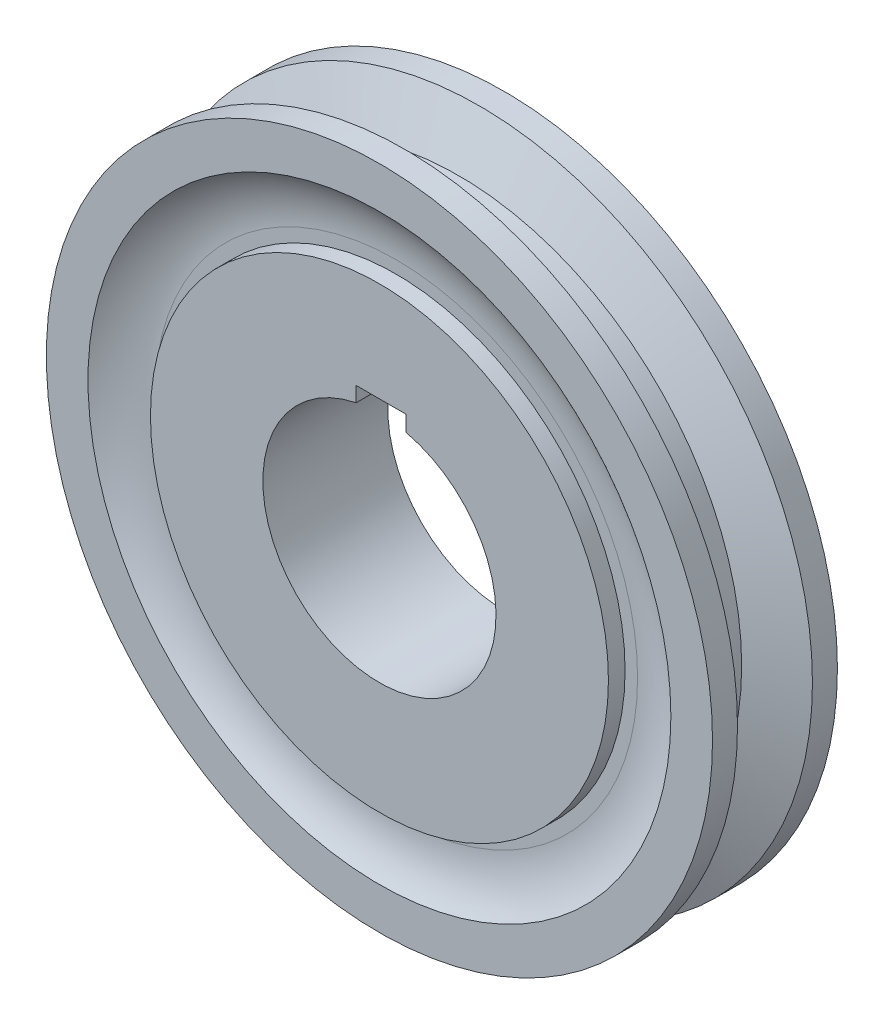
ISO-10303-21;
HEADER;
FILE_DESCRIPTION(('STEP AP214'),'2;1');
FILE_NAME('part.step','',(''),(''),'','','');
FILE_SCHEMA(('AUTOMOTIVE_DESIGN { 1 0 10303 214 1 1 1 1 }'));
ENDSEC;
DATA;
#1=APPLICATION_CONTEXT('core data for automotive mechanical design processes');
#2=APPLICATION_PROTOCOL_DEFINITION('international standard','automotive_design',2000,#1);
#3=PRODUCT_CONTEXT('',#1,'mechanical');
#4=PRODUCT('Part','Part','',(#3));
#5=PRODUCT_RELATED_PRODUCT_CATEGORY('part','',(#4));
#6=PRODUCT_DEFINITION_FORMATION('','',#4);
#7=PRODUCT_DEFINITION_CONTEXT('part definition',#1,'design');
#8=PRODUCT_DEFINITION('design','',#6,#7);
#9=PRODUCT_DEFINITION_SHAPE('','',#8);
#10=(LENGTH_UNIT() NAMED_UNIT(*) SI_UNIT(.MILLI.,.METRE.));
#11=(NAMED_UNIT(*) PLANE_ANGLE_UNIT() SI_UNIT($,.RADIAN.));
#12=(NAMED_UNIT(*) SI_UNIT($,.STERADIAN.) SOLID_ANGLE_UNIT());
#13=UNCERTAINTY_MEASURE_WITH_UNIT(LENGTH_MEASURE(1.E-05),#10,'distance_accuracy_value','');
#14=(GEOMETRIC_REPRESENTATION_CONTEXT(3) GLOBAL_UNCERTAINTY_ASSIGNED_CONTEXT((#13)) GLOBAL_UNIT_ASSIGNED_CONTEXT((#10,
#11,#12)) REPRESENTATION_CONTEXT('',''));
#15=CARTESIAN_POINT('',(0.,0.,0.));
#16=DIRECTION('',(0.,0.,1.));
#17=DIRECTION('',(1.,0.,0.));
#18=AXIS2_PLACEMENT_3D('',#15,#16,#17);
#19=CARTESIAN_POINT('',(0.,0.,-7.5));
#20=DIRECTION('',(0.,0.,-1.));
#21=DIRECTION('',(-1.,0.,0.));
#22=AXIS2_PLACEMENT_3D('',#19,#20,#21);
#23=PLANE('',#22);
#24=CARTESIAN_POINT('',(0.,0.,-7.49999999999995));
#25=DIRECTION('',(0.,0.,1.));
#26=DIRECTION('',(1.,0.,0.));
#27=AXIS2_PLACEMENT_3D('',#24,#25,#26);
#28=CIRCLE('',#27,14.);
#29=CARTESIAN_POINT('',(-2.8,13.7171425595858,-7.49999999999995));
#30=VERTEX_POINT('',#29);
#31=CARTESIAN_POINT('',(3.2,13.6293800299207,-7.49999999999995));
#32=VERTEX_POINT('',#31);
#33=EDGE_CURVE('E89',#30,#32,#28,.T.);
#34=ORIENTED_EDGE('',*,*,#33,.T.);
#35=DIRECTION('',(0.,1.,0.));
#36=VECTOR('',#35,1.);
#37=CARTESIAN_POINT('',(3.2,15.5202041028867,-7.49999999999995));
#38=LINE('',#37,#36);
#39=CARTESIAN_POINT('',(3.2,15.5202041028867,-7.5));
#40=VERTEX_POINT('',#39);
#41=EDGE_CURVE('E99',#32,#40,#38,.T.);
#42=ORIENTED_EDGE('',*,*,#41,.T.);
#43=DIRECTION('',(-1.,0.,0.));
#44=VECTOR('',#43,1.);
#45=CARTESIAN_POINT('',(3.2,15.5202041028867,-7.49999999999995));
#46=LINE('',#45,#44);
#47=CARTESIAN_POINT('',(-2.8,15.5202041028867,-7.49999999999995));
#48=VERTEX_POINT('',#47);
#49=EDGE_CURVE('E69',#40,#48,#46,.T.);
#50=ORIENTED_EDGE('',*,*,#49,.T.);
#51=DIRECTION('',(0.,-1.,0.));
#52=VECTOR('',#51,1.);
#53=CARTESIAN_POINT('',(-2.8,15.5202041028867,-7.49999999999995));
#54=LINE('',#53,#52);
#55=EDGE_CURVE('E96',#48,#30,#54,.T.);
#56=ORIENTED_EDGE('',*,*,#55,.T.);
#57=EDGE_LOOP('',(#34,#42,#50,#56));
#58=FACE_BOUND('',#57,.T.);
#59=CARTESIAN_POINT('',(0.,0.,-7.5));
#60=DIRECTION('',(0.,0.,-1.));
#61=DIRECTION('',(-1.,0.,0.));
#62=AXIS2_PLACEMENT_3D('',#59,#60,#61);
#63=CIRCLE('',#62,27.5);
#64=CARTESIAN_POINT('',(-27.5,0.,-7.5));
#65=VERTEX_POINT('',#64);
#66=EDGE_CURVE('E252',#65,#65,#63,.T.);
#67=ORIENTED_EDGE('',*,*,#66,.T.);
#68=EDGE_LOOP('',(#67));
#69=FACE_BOUND('',#68,.T.);
#70=ADVANCED_FACE('F45',(#58,#69),#23,.T.);
#71=CARTESIAN_POINT('',(0.,0.,7.5));
#72=DIRECTION('',(0.,0.,-1.));
#73=DIRECTION('',(-1.,0.,0.));
#74=AXIS2_PLACEMENT_3D('',#71,#72,#73);
#75=PLANE('',#74);
#76=DIRECTION('',(0.,1.,0.));
#77=VECTOR('',#76,1.);
#78=CARTESIAN_POINT('',(3.2,15.5202041028867,7.5));
#79=LINE('',#78,#77);
#80=CARTESIAN_POINT('',(3.2,13.6293800299207,7.5));
#81=VERTEX_POINT('',#80);
#82=CARTESIAN_POINT('',(3.2,15.5202041028867,7.5));
#83=VERTEX_POINT('',#82);
#84=EDGE_CURVE('E123',#81,#83,#79,.T.);
#85=ORIENTED_EDGE('',*,*,#84,.F.);
#86=CARTESIAN_POINT('',(0.,0.,7.5));
#87=DIRECTION('',(0.,0.,1.));
#88=DIRECTION('',(1.,0.,0.));
#89=AXIS2_PLACEMENT_3D('',#86,#87,#88);
#90=CIRCLE('',#89,14.);
#91=CARTESIAN_POINT('',(-2.8,13.7171425595858,7.5));
#92=VERTEX_POINT('',#91);
#93=EDGE_CURVE('E61',#92,#81,#90,.T.);
#94=ORIENTED_EDGE('',*,*,#93,.F.);
#95=DIRECTION('',(0.,-1.,0.));
#96=VECTOR('',#95,1.);
#97=CARTESIAN_POINT('',(-2.8,15.5202041028867,7.5));
#98=LINE('',#97,#96);
#99=CARTESIAN_POINT('',(-2.8,15.5202041028867,7.5));
#100=VERTEX_POINT('',#99);
#101=EDGE_CURVE('E107',#100,#92,#98,.T.);
#102=ORIENTED_EDGE('',*,*,#101,.F.);
#103=DIRECTION('',(-1.,0.,0.));
#104=VECTOR('',#103,1.);
#105=CARTESIAN_POINT('',(3.2,15.5202041028867,7.5));
#106=LINE('',#105,#104);
#107=EDGE_CURVE('E111',#83,#100,#106,.T.);
#108=ORIENTED_EDGE('',*,*,#107,.F.);
#109=EDGE_LOOP('',(#85,#94,#102,#108));
#110=FACE_BOUND('',#109,.T.);
#111=CARTESIAN_POINT('',(0.,0.,7.5));
#112=DIRECTION('',(0.,0.,1.));
#113=DIRECTION('',(1.,0.,0.));
#114=AXIS2_PLACEMENT_3D('',#111,#112,#113);
#115=CIRCLE('',#114,27.5);
#116=CARTESIAN_POINT('',(27.5,0.,7.5));
#117=VERTEX_POINT('',#116);
#118=EDGE_CURVE('E256',#117,#117,#115,.T.);
#119=ORIENTED_EDGE('',*,*,#118,.T.);
#120=EDGE_LOOP('',(#119));
#121=FACE_BOUND('',#120,.T.);
#122=ADVANCED_FACE('F182',(#110,#121),#75,.F.);
#123=CARTESIAN_POINT('',(0.,0.,652.003718610747));
#124=DIRECTION('',(0.,0.,1.));
#125=DIRECTION('',(1.,0.,0.));
#126=AXIS2_PLACEMENT_3D('',#123,#124,#125);
#127=CYLINDRICAL_SURFACE('',#126,40.);
#128=CARTESIAN_POINT('',(0.,0.,4.49999999999995));
#129=DIRECTION('',(0.,0.,1.));
#130=DIRECTION('',(1.,0.,0.));
#131=AXIS2_PLACEMENT_3D('',#128,#129,#130);
#132=CIRCLE('',#131,40.);
#133=CARTESIAN_POINT('',(40.,0.,4.49999999999995));
#134=VERTEX_POINT('',#133);
#135=EDGE_CURVE('E132',#134,#134,#132,.T.);
#136=ORIENTED_EDGE('',*,*,#135,.T.);
#137=EDGE_LOOP('',(#136));
#138=FACE_BOUND('',#137,.T.);
#139=CARTESIAN_POINT('',(0.,0.,7.49999999999995));
#140=DIRECTION('',(0.,0.,1.));
#141=DIRECTION('',(1.,0.,0.));
#142=AXIS2_PLACEMENT_3D('',#139,#140,#141);
#143=CIRCLE('',#142,40.);
#144=CARTESIAN_POINT('',(40.,0.,7.49999999999995));
#145=VERTEX_POINT('',#144);
#146=EDGE_CURVE('E157',#145,#145,#143,.T.);
#147=ORIENTED_EDGE('',*,*,#146,.F.);
#148=EDGE_LOOP('',(#147));
#149=FACE_BOUND('',#148,.T.);
#150=ADVANCED_FACE('F188',(#138,#149),#127,.T.);
#151=CARTESIAN_POINT('',(0.,0.,7.5));
#152=DIRECTION('',(0.,0.,1.));
#153=DIRECTION('',(1.,0.,0.));
#154=AXIS2_PLACEMENT_3D('',#151,#152,#153);
#155=CIRCLE('',#154,35.);
#156=CARTESIAN_POINT('',(35.,0.,7.5));
#157=VERTEX_POINT('',#156);
#158=EDGE_CURVE('E114',#157,#157,#155,.T.);
#159=ORIENTED_EDGE('',*,*,#158,.F.);
#160=EDGE_LOOP('',(#159));
#161=FACE_BOUND('',#160,.T.);
#162=ORIENTED_EDGE('',*,*,#146,.T.);
#163=EDGE_LOOP('',(#162));
#164=FACE_BOUND('',#163,.T.);
#165=ADVANCED_FACE('F191',(#161,#164),#75,.F.);
#166=CARTESIAN_POINT('',(0.,0.,-7.5));
#167=DIRECTION('',(0.,0.,-1.));
#168=DIRECTION('',(-1.,0.,0.));
#169=AXIS2_PLACEMENT_3D('',#166,#167,#168);
#170=CIRCLE('',#169,35.);
#171=CARTESIAN_POINT('',(-35.,0.,-7.5));
#172=VERTEX_POINT('',#171);
#173=EDGE_CURVE('E206',#172,#172,#170,.T.);
#174=ORIENTED_EDGE('',*,*,#173,.F.);
#175=EDGE_LOOP('',(#174));
#176=FACE_BOUND('',#175,.T.);
#177=CARTESIAN_POINT('',(0.,0.,-7.49999999999995));
#178=DIRECTION('',(0.,0.,1.));
#179=DIRECTION('',(1.,0.,0.));
#180=AXIS2_PLACEMENT_3D('',#177,#178,#179);
#181=CIRCLE('',#180,40.);
#182=CARTESIAN_POINT('',(40.,0.,-7.49999999999995));
#183=VERTEX_POINT('',#182);
#184=EDGE_CURVE('E153',#183,#183,#181,.T.);
#185=ORIENTED_EDGE('',*,*,#184,.F.);
#186=EDGE_LOOP('',(#185));
#187=FACE_BOUND('',#186,.T.);
#188=ADVANCED_FACE('F184',(#176,#187),#23,.T.);
#189=CARTESIAN_POINT('',(0.,0.,652.003718610747));
#190=DIRECTION('',(0.,0.,1.));
#191=DIRECTION('',(1.,0.,0.));
#192=AXIS2_PLACEMENT_3D('',#189,#190,#191);
#193=CYLINDRICAL_SURFACE('',#192,40.);
#194=ORIENTED_EDGE('',*,*,#184,.T.);
#195=EDGE_LOOP('',(#194));
#196=FACE_BOUND('',#195,.T.);
#197=CARTESIAN_POINT('',(0.,0.,-4.49999999999995));
#198=DIRECTION('',(0.,0.,1.));
#199=DIRECTION('',(1.,0.,0.));
#200=AXIS2_PLACEMENT_3D('',#197,#198,#199);
#201=CIRCLE('',#200,40.);
#202=CARTESIAN_POINT('',(40.,0.,-4.49999999999995));
#203=VERTEX_POINT('',#202);
#204=EDGE_CURVE('E149',#203,#203,#201,.T.);
#205=ORIENTED_EDGE('',*,*,#204,.F.);
#206=EDGE_LOOP('',(#205));
#207=FACE_BOUND('',#206,.T.);
#208=ADVANCED_FACE('F194',(#196,#207),#193,.T.);
#209=CARTESIAN_POINT('',(0.,0.,-4.49999999999995));
#210=DIRECTION('',(0.,0.,-1.));
#211=DIRECTION('',(-1.,0.,0.));
#212=AXIS2_PLACEMENT_3D('',#209,#210,#211);
#213=CONICAL_SURFACE('',#212,40.,1.17600520709514);
#214=CARTESIAN_POINT('',(0.,0.,-2.));
#215=DIRECTION('',(0.,0.,1.));
#216=DIRECTION('',(1.,0.,0.));
#217=AXIS2_PLACEMENT_3D('',#214,#215,#216);
#218=CIRCLE('',#217,34.);
#219=CARTESIAN_POINT('',(34.,0.,-2.));
#220=VERTEX_POINT('',#219);
#221=EDGE_CURVE('E145',#220,#220,#218,.T.);
#222=ORIENTED_EDGE('',*,*,#221,.F.);
#223=EDGE_LOOP('',(#222));
#224=FACE_BOUND('',#223,.T.);
#225=ORIENTED_EDGE('',*,*,#204,.T.);
#226=EDGE_LOOP('',(#225));
#227=FACE_BOUND('',#226,.T.);
#228=ADVANCED_FACE('F200',(#224,#227),#213,.T.);
#229=CARTESIAN_POINT('',(0.,0.,652.003718610747));
#230=DIRECTION('',(0.,0.,1.));
#231=DIRECTION('',(1.,0.,0.));
#232=AXIS2_PLACEMENT_3D('',#229,#230,#231);
#233=CYLINDRICAL_SURFACE('',#232,34.);
#234=CARTESIAN_POINT('',(0.,0.,2.));
#235=DIRECTION('',(0.,0.,1.));
#236=DIRECTION('',(1.,0.,0.));
#237=AXIS2_PLACEMENT_3D('',#234,#235,#236);
#238=CIRCLE('',#237,34.);
#239=CARTESIAN_POINT('',(34.,0.,2.));
#240=VERTEX_POINT('',#239);
#241=EDGE_CURVE('E141',#240,#240,#238,.T.);
#242=ORIENTED_EDGE('',*,*,#241,.F.);
#243=EDGE_LOOP('',(#242));
#244=FACE_BOUND('',#243,.T.);
#245=ORIENTED_EDGE('',*,*,#221,.T.);
#246=EDGE_LOOP('',(#245));
#247=FACE_BOUND('',#246,.T.);
#248=ADVANCED_FACE('F212',(#244,#247),#233,.T.);
#249=CARTESIAN_POINT('',(0.,0.,4.49999999999995));
#250=DIRECTION('',(0.,0.,1.));
#251=DIRECTION('',(1.,0.,0.));
#252=AXIS2_PLACEMENT_3D('',#249,#250,#251);
#253=CONICAL_SURFACE('',#252,40.,1.17600520709514);
#254=ORIENTED_EDGE('',*,*,#241,.T.);
#255=EDGE_LOOP('',(#254));
#256=FACE_BOUND('',#255,.T.);
#257=ORIENTED_EDGE('',*,*,#135,.F.);
#258=EDGE_LOOP('',(#257));
#259=FACE_BOUND('',#258,.T.);
#260=ADVANCED_FACE('F218',(#256,#259),#253,.T.);
#261=CARTESIAN_POINT('',(0.,0.,-7.49999999999995));
#262=DIRECTION('',(0.,0.,1.));
#263=DIRECTION('',(1.,0.,0.));
#264=AXIS2_PLACEMENT_3D('',#261,#262,#263);
#265=CYLINDRICAL_SURFACE('',#264,14.);
#266=ORIENTED_EDGE('',*,*,#93,.T.);
#267=DIRECTION('',(0.,0.,1.));
#268=VECTOR('',#267,1.);
#269=CARTESIAN_POINT('',(3.2,13.6293800299207,-7.49999999999995));
#270=LINE('',#269,#268);
#271=EDGE_CURVE('E85',#32,#81,#270,.T.);
#272=ORIENTED_EDGE('',*,*,#271,.F.);
#273=ORIENTED_EDGE('',*,*,#33,.F.);
#274=DIRECTION('',(0.,0.,1.));
#275=VECTOR('',#274,1.);
#276=CARTESIAN_POINT('',(-2.8,13.7171425595858,-7.49999999999995));
#277=LINE('',#276,#275);
#278=EDGE_CURVE('E129',#30,#92,#277,.T.);
#279=ORIENTED_EDGE('',*,*,#278,.T.);
#280=EDGE_LOOP('',(#266,#272,#273,#279));
#281=FACE_BOUND('',#280,.T.);
#282=ADVANCED_FACE('F87',(#281),#265,.F.);
#283=CARTESIAN_POINT('',(-2.8,15.5202041028867,-7.49999999999995));
#284=DIRECTION('',(-1.,0.,0.));
#285=DIRECTION('',(0.,-1.,0.));
#286=AXIS2_PLACEMENT_3D('',#283,#284,#285);
#287=PLANE('',#286);
#288=ORIENTED_EDGE('',*,*,#101,.T.);
#289=ORIENTED_EDGE('',*,*,#278,.F.);
#290=ORIENTED_EDGE('',*,*,#55,.F.);
#291=DIRECTION('',(0.,0.,1.));
#292=VECTOR('',#291,1.);
#293=CARTESIAN_POINT('',(-2.8,15.5202041028867,-7.49999999999995));
#294=LINE('',#293,#292);
#295=EDGE_CURVE('E133',#48,#100,#294,.T.);
#296=ORIENTED_EDGE('',*,*,#295,.T.);
#297=EDGE_LOOP('',(#288,#289,#290,#296));
#298=FACE_BOUND('',#297,.T.);
#299=ADVANCED_FACE('F228',(#298),#287,.F.);
#300=CARTESIAN_POINT('',(3.2,15.5202041028867,-7.49999999999995));
#301=DIRECTION('',(0.,1.,0.));
#302=DIRECTION('',(0.,0.,1.));
#303=AXIS2_PLACEMENT_3D('',#300,#301,#302);
#304=PLANE('',#303);
#305=ORIENTED_EDGE('',*,*,#107,.T.);
#306=ORIENTED_EDGE('',*,*,#295,.F.);
#307=ORIENTED_EDGE('',*,*,#49,.F.);
#308=DIRECTION('',(0.,0.,1.));
#309=VECTOR('',#308,1.);
#310=CARTESIAN_POINT('',(3.2,15.5202041028867,-7.49999999999995));
#311=LINE('',#310,#309);
#312=EDGE_CURVE('E95',#40,#83,#311,.T.);
#313=ORIENTED_EDGE('',*,*,#312,.T.);
#314=EDGE_LOOP('',(#305,#306,#307,#313));
#315=FACE_BOUND('',#314,.T.);
#316=ADVANCED_FACE('F231',(#315),#304,.F.);
#317=CARTESIAN_POINT('',(3.2,15.5202041028867,-7.49999999999995));
#318=DIRECTION('',(1.,0.,0.));
#319=DIRECTION('',(0.,1.,0.));
#320=AXIS2_PLACEMENT_3D('',#317,#318,#319);
#321=PLANE('',#320);
#322=ORIENTED_EDGE('',*,*,#84,.T.);
#323=ORIENTED_EDGE('',*,*,#312,.F.);
#324=ORIENTED_EDGE('',*,*,#41,.F.);
#325=ORIENTED_EDGE('',*,*,#271,.T.);
#326=EDGE_LOOP('',(#322,#323,#324,#325));
#327=FACE_BOUND('',#326,.T.);
#328=ADVANCED_FACE('F100',(#327),#321,.F.);
#329=CARTESIAN_POINT('',(0.,0.,5.5));
#330=DIRECTION('',(0.,0.,1.));
#331=DIRECTION('',(1.,0.,0.));
#332=AXIS2_PLACEMENT_3D('',#329,#330,#331);
#333=PLANE('',#332);
#334=CARTESIAN_POINT('',(0.,0.,5.5));
#335=DIRECTION('',(0.,0.,1.));
#336=DIRECTION('',(1.,0.,0.));
#337=AXIS2_PLACEMENT_3D('',#334,#335,#336);
#338=CIRCLE('',#337,29.);
#339=CARTESIAN_POINT('',(29.,0.,5.5));
#340=VERTEX_POINT('',#339);
#341=EDGE_CURVE('E54',#340,#340,#338,.T.);
#342=ORIENTED_EDGE('',*,*,#341,.T.);
#343=EDGE_LOOP('',(#342));
#344=FACE_BOUND('',#343,.T.);
#345=CARTESIAN_POINT('',(0.,0.,5.5));
#346=DIRECTION('',(0.,0.,1.));
#347=DIRECTION('',(1.,0.,0.));
#348=AXIS2_PLACEMENT_3D('',#345,#346,#347);
#349=CIRCLE('',#348,27.5);
#350=CARTESIAN_POINT('',(27.5,0.,5.5));
#351=VERTEX_POINT('',#350);
#352=EDGE_CURVE('E261',#351,#351,#349,.T.);
#353=ORIENTED_EDGE('',*,*,#352,.F.);
#354=EDGE_LOOP('',(#353));
#355=FACE_BOUND('',#354,.T.);
#356=ADVANCED_FACE('F164',(#344,#355),#333,.T.);
#357=CARTESIAN_POINT('',(0.,0.,5.5));
#358=DIRECTION('',(0.,0.,1.));
#359=DIRECTION('',(1.,0.,0.));
#360=AXIS2_PLACEMENT_3D('',#357,#358,#359);
#361=CYLINDRICAL_SURFACE('',#360,27.5);
#362=ORIENTED_EDGE('',*,*,#352,.T.);
#363=EDGE_LOOP('',(#362));
#364=FACE_BOUND('',#363,.T.);
#365=ORIENTED_EDGE('',*,*,#118,.F.);
#366=EDGE_LOOP('',(#365));
#367=FACE_BOUND('',#366,.T.);
#368=ADVANCED_FACE('F239',(#364,#367),#361,.T.);
#369=CARTESIAN_POINT('',(0.,0.,-5.5));
#370=DIRECTION('',(0.,0.,-1.));
#371=DIRECTION('',(-1.,0.,0.));
#372=AXIS2_PLACEMENT_3D('',#369,#370,#371);
#373=CYLINDRICAL_SURFACE('',#372,35.);
#374=CARTESIAN_POINT('',(0.,0.,-5.5));
#375=DIRECTION('',(0.,0.,-1.));
#376=DIRECTION('',(-1.,0.,0.));
#377=AXIS2_PLACEMENT_3D('',#374,#375,#376);
#378=CIRCLE('',#377,35.);
#379=CARTESIAN_POINT('',(-35.,0.,-5.5));
#380=VERTEX_POINT('',#379);
#381=EDGE_CURVE('E250',#380,#380,#378,.T.);
#382=ORIENTED_EDGE('',*,*,#381,.F.);
#383=EDGE_LOOP('',(#382));
#384=FACE_BOUND('',#383,.T.);
#385=ORIENTED_EDGE('',*,*,#173,.T.);
#386=EDGE_LOOP('',(#385));
#387=FACE_BOUND('',#386,.T.);
#388=ADVANCED_FACE('F176',(#384,#387),#373,.F.);
#389=CARTESIAN_POINT('',(0.,0.,-5.5));
#390=DIRECTION('',(0.,0.,-1.));
#391=DIRECTION('',(-1.,0.,0.));
#392=AXIS2_PLACEMENT_3D('',#389,#390,#391);
#393=PLANE('',#392);
#394=CARTESIAN_POINT('',(0.,0.,-5.5));
#395=DIRECTION('',(0.,0.,-1.));
#396=DIRECTION('',(-1.,0.,0.));
#397=AXIS2_PLACEMENT_3D('',#394,#395,#396);
#398=CIRCLE('',#397,33.5);
#399=CARTESIAN_POINT('',(-33.5,0.,-5.5));
#400=VERTEX_POINT('',#399);
#401=EDGE_CURVE('E11',#400,#400,#398,.F.);
#402=ORIENTED_EDGE('',*,*,#401,.T.);
#403=EDGE_LOOP('',(#402));
#404=FACE_BOUND('',#403,.T.);
#405=ORIENTED_EDGE('',*,*,#381,.T.);
#406=EDGE_LOOP('',(#405));
#407=FACE_BOUND('',#406,.T.);
#408=ADVANCED_FACE('F169',(#404,#407),#393,.T.);
#409=CARTESIAN_POINT('',(0.,0.,15.5));
#410=DIRECTION('',(0.,0.,-1.));
#411=DIRECTION('',(-1.,0.,0.));
#412=AXIS2_PLACEMENT_3D('',#409,#410,#411);
#413=TOROIDAL_SURFACE('',#412,29.,10.);
#414=ORIENTED_EDGE('',*,*,#158,.T.);
#415=EDGE_LOOP('',(#414));
#416=FACE_BOUND('',#415,.T.);
#417=ORIENTED_EDGE('',*,*,#341,.F.);
#418=EDGE_LOOP('',(#417));
#419=FACE_BOUND('',#418,.T.);
#420=ADVANCED_FACE('F167',(#416,#419),#413,.F.);
#421=CARTESIAN_POINT('',(0.,0.,-15.5));
#422=DIRECTION('',(0.,0.,-1.));
#423=DIRECTION('',(-1.,0.,0.));
#424=AXIS2_PLACEMENT_3D('',#421,#422,#423);
#425=TOROIDAL_SURFACE('',#424,33.5,10.);
#426=ORIENTED_EDGE('',*,*,#401,.F.);
#427=EDGE_LOOP('',(#426));
#428=FACE_BOUND('',#427,.T.);
#429=ORIENTED_EDGE('',*,*,#66,.F.);
#430=EDGE_LOOP('',(#429));
#431=FACE_BOUND('',#430,.T.);
#432=ADVANCED_FACE('F47',(#428,#431),#425,.F.);
#433=CLOSED_SHELL('',(#70,#122,#150,#165,#188,#208,#228,#248,#260,#282,#299,#316,#328,#356,#368,
#388,#408,#420,#432));
#434=MANIFOLD_SOLID_BREP('B2',#433);
#435=ADVANCED_BREP_SHAPE_REPRESENTATION('',(#18,#434),#14);
#436=SHAPE_DEFINITION_REPRESENTATION(#9,#435);
ENDSEC;
END-ISO-10303-21;
